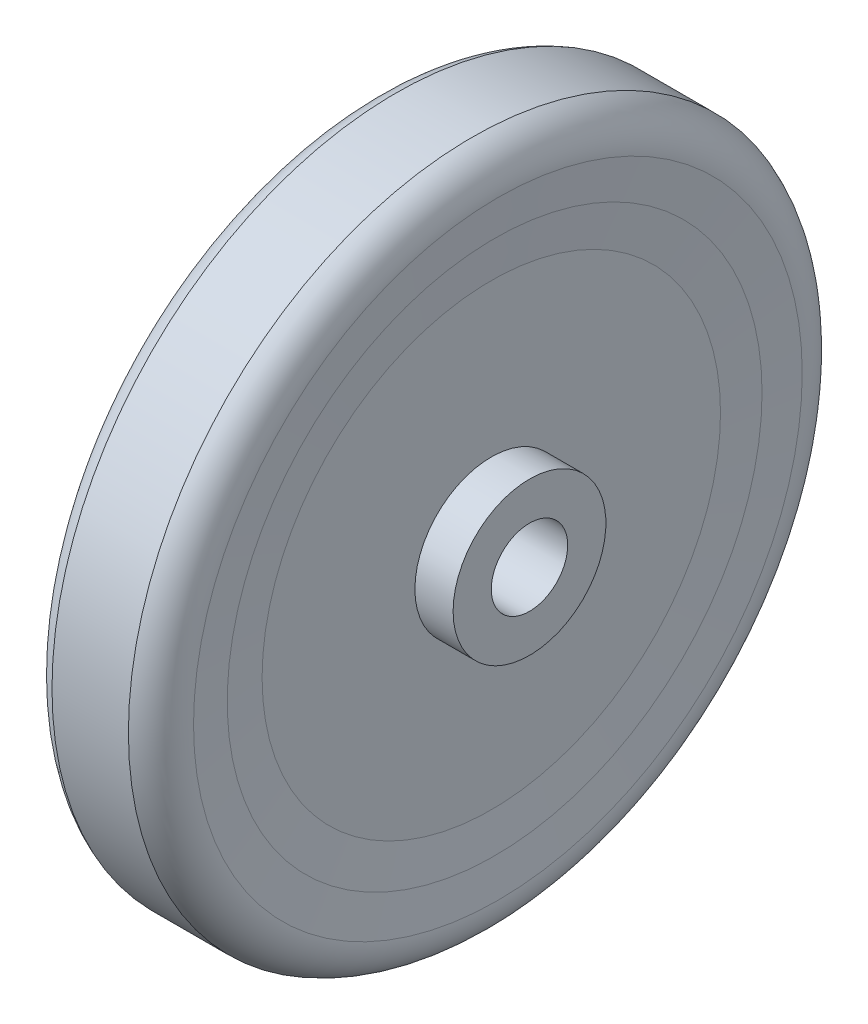
ISO-10303-21;
HEADER;
FILE_DESCRIPTION(('STEP AP214'),'2;1');
FILE_NAME('part.step','',(''),(''),'','','');
FILE_SCHEMA(('AUTOMOTIVE_DESIGN { 1 0 10303 214 1 1 1 1 }'));
ENDSEC;
DATA;
#1=APPLICATION_CONTEXT('core data for automotive mechanical design processes');
#2=APPLICATION_PROTOCOL_DEFINITION('international standard','automotive_design',2000,#1);
#3=PRODUCT_CONTEXT('',#1,'mechanical');
#4=PRODUCT('Part','Part','',(#3));
#5=PRODUCT_RELATED_PRODUCT_CATEGORY('part','',(#4));
#6=PRODUCT_DEFINITION_FORMATION('','',#4);
#7=PRODUCT_DEFINITION_CONTEXT('part definition',#1,'design');
#8=PRODUCT_DEFINITION('design','',#6,#7);
#9=PRODUCT_DEFINITION_SHAPE('','',#8);
#10=(LENGTH_UNIT() NAMED_UNIT(*) SI_UNIT(.MILLI.,.METRE.));
#11=(NAMED_UNIT(*) PLANE_ANGLE_UNIT() SI_UNIT($,.RADIAN.));
#12=(NAMED_UNIT(*) SI_UNIT($,.STERADIAN.) SOLID_ANGLE_UNIT());
#13=UNCERTAINTY_MEASURE_WITH_UNIT(LENGTH_MEASURE(1.E-05),#10,'distance_accuracy_value','');
#14=(GEOMETRIC_REPRESENTATION_CONTEXT(3) GLOBAL_UNCERTAINTY_ASSIGNED_CONTEXT((#13)) GLOBAL_UNIT_ASSIGNED_CONTEXT((#10,
#11,#12)) REPRESENTATION_CONTEXT('',''));
#15=CARTESIAN_POINT('',(0.,0.,0.));
#16=DIRECTION('',(0.,0.,1.));
#17=DIRECTION('',(1.,0.,0.));
#18=AXIS2_PLACEMENT_3D('',#15,#16,#17);
#19=CARTESIAN_POINT('',(-9.00000000000001,0.,0.));
#20=DIRECTION('',(1.,0.,0.));
#21=DIRECTION('',(0.,0.,-1.));
#22=AXIS2_PLACEMENT_3D('',#19,#20,#21);
#23=CYLINDRICAL_SURFACE('',#22,35.);
#24=CARTESIAN_POINT('',(-7.93744331762962,0.,0.));
#25=DIRECTION('',(-1.,0.,0.));
#26=DIRECTION('',(0.,0.,1.));
#27=AXIS2_PLACEMENT_3D('',#24,#25,#26);
#28=CIRCLE('',#27,35.);
#29=CARTESIAN_POINT('',(-7.93744331762962,0.,35.));
#30=VERTEX_POINT('',#29);
#31=EDGE_CURVE('E63',#30,#30,#28,.F.);
#32=ORIENTED_EDGE('',*,*,#31,.T.);
#33=EDGE_LOOP('',(#32));
#34=FACE_BOUND('',#33,.T.);
#35=CARTESIAN_POINT('',(7.93744331762962,0.,0.));
#36=DIRECTION('',(1.,0.,0.));
#37=DIRECTION('',(0.,0.,-1.));
#38=AXIS2_PLACEMENT_3D('',#35,#36,#37);
#39=CIRCLE('',#38,35.);
#40=CARTESIAN_POINT('',(7.93744331762962,0.,-35.));
#41=VERTEX_POINT('',#40);
#42=EDGE_CURVE('E51',#41,#41,#39,.F.);
#43=ORIENTED_EDGE('',*,*,#42,.T.);
#44=EDGE_LOOP('',(#43));
#45=FACE_BOUND('',#44,.T.);
#46=ADVANCED_FACE('F47',(#34,#45),#23,.T.);
#47=CARTESIAN_POINT('',(-8.36037581904776,0.,0.));
#48=DIRECTION('',(-1.,0.,0.));
#49=DIRECTION('',(0.,0.,1.));
#50=AXIS2_PLACEMENT_3D('',#47,#48,#49);
#51=CONICAL_SURFACE('',#50,39.834140611747,1.48352986419518);
#52=CARTESIAN_POINT('',(-7.5,0.,0.));
#53=DIRECTION('',(-1.,0.,0.));
#54=DIRECTION('',(0.,0.,1.));
#55=AXIS2_PLACEMENT_3D('',#52,#53,#54);
#56=CIRCLE('',#55,30.);
#57=CARTESIAN_POINT('',(-7.5,0.,30.));
#58=VERTEX_POINT('',#57);
#59=EDGE_CURVE('E65',#58,#58,#56,.T.);
#60=ORIENTED_EDGE('',*,*,#59,.F.);
#61=EDGE_LOOP('',(#60));
#62=FACE_BOUND('',#61,.T.);
#63=ORIENTED_EDGE('',*,*,#31,.F.);
#64=EDGE_LOOP('',(#63));
#65=FACE_BOUND('',#64,.T.);
#66=ADVANCED_FACE('F49',(#62,#65),#51,.F.);
#67=CARTESIAN_POINT('',(7.5,0.,0.));
#68=DIRECTION('',(1.,0.,0.));
#69=DIRECTION('',(0.,0.,-1.));
#70=AXIS2_PLACEMENT_3D('',#67,#68,#69);
#71=CONICAL_SURFACE('',#70,30.,1.48352986419518);
#72=CARTESIAN_POINT('',(7.5,0.,0.));
#73=DIRECTION('',(-1.,0.,0.));
#74=DIRECTION('',(0.,0.,1.));
#75=AXIS2_PLACEMENT_3D('',#72,#73,#74);
#76=CIRCLE('',#75,30.);
#77=CARTESIAN_POINT('',(7.5,0.,30.));
#78=VERTEX_POINT('',#77);
#79=EDGE_CURVE('E69',#78,#78,#76,.T.);
#80=ORIENTED_EDGE('',*,*,#79,.T.);
#81=EDGE_LOOP('',(#80));
#82=FACE_BOUND('',#81,.T.);
#83=ORIENTED_EDGE('',*,*,#42,.F.);
#84=EDGE_LOOP('',(#83));
#85=FACE_BOUND('',#84,.T.);
#86=ADVANCED_FACE('F75',(#82,#85),#71,.F.);
#87=CARTESIAN_POINT('',(-7.5,10.,0.));
#88=DIRECTION('',(1.,0.,0.));
#89=DIRECTION('',(0.,0.,-1.));
#90=AXIS2_PLACEMENT_3D('',#87,#88,#89);
#91=PLANE('',#90);
#92=CARTESIAN_POINT('',(-7.5,0.,0.));
#93=DIRECTION('',(-1.,0.,0.));
#94=DIRECTION('',(0.,0.,1.));
#95=AXIS2_PLACEMENT_3D('',#92,#93,#94);
#96=CIRCLE('',#95,10.);
#97=CARTESIAN_POINT('',(-7.5,0.,10.));
#98=VERTEX_POINT('',#97);
#99=EDGE_CURVE('E11',#98,#98,#96,.T.);
#100=ORIENTED_EDGE('',*,*,#99,.F.);
#101=EDGE_LOOP('',(#100));
#102=FACE_BOUND('',#101,.T.);
#103=ORIENTED_EDGE('',*,*,#59,.T.);
#104=EDGE_LOOP('',(#103));
#105=FACE_BOUND('',#104,.T.);
#106=ADVANCED_FACE('F77',(#102,#105),#91,.F.);
#107=CARTESIAN_POINT('',(7.5,30.,0.));
#108=DIRECTION('',(-1.,0.,0.));
#109=DIRECTION('',(0.,0.,1.));
#110=AXIS2_PLACEMENT_3D('',#107,#108,#109);
#111=PLANE('',#110);
#112=ORIENTED_EDGE('',*,*,#79,.F.);
#113=EDGE_LOOP('',(#112));
#114=FACE_BOUND('',#113,.T.);
#115=CARTESIAN_POINT('',(7.5,0.,0.));
#116=DIRECTION('',(-1.,0.,0.));
#117=DIRECTION('',(0.,0.,1.));
#118=AXIS2_PLACEMENT_3D('',#115,#116,#117);
#119=CIRCLE('',#118,10.);
#120=CARTESIAN_POINT('',(7.5,0.,10.));
#121=VERTEX_POINT('',#120);
#122=EDGE_CURVE('E119',#121,#121,#119,.T.);
#123=ORIENTED_EDGE('',*,*,#122,.T.);
#124=EDGE_LOOP('',(#123));
#125=FACE_BOUND('',#124,.T.);
#126=ADVANCED_FACE('F83',(#114,#125),#111,.F.);
#127=CARTESIAN_POINT('',(0.,0.,0.));
#128=DIRECTION('',(-1.,0.,0.));
#129=DIRECTION('',(0.,0.,1.));
#130=AXIS2_PLACEMENT_3D('',#127,#128,#129);
#131=CYLINDRICAL_SURFACE('',#130,10.);
#132=ORIENTED_EDGE('',*,*,#122,.F.);
#133=EDGE_LOOP('',(#132));
#134=FACE_BOUND('',#133,.T.);
#135=CARTESIAN_POINT('',(12.5,0.,0.));
#136=DIRECTION('',(-1.,0.,0.));
#137=DIRECTION('',(0.,0.,1.));
#138=AXIS2_PLACEMENT_3D('',#135,#136,#137);
#139=CIRCLE('',#138,10.);
#140=CARTESIAN_POINT('',(12.5,0.,10.));
#141=VERTEX_POINT('',#140);
#142=EDGE_CURVE('E120',#141,#141,#139,.T.);
#143=ORIENTED_EDGE('',*,*,#142,.T.);
#144=EDGE_LOOP('',(#143));
#145=FACE_BOUND('',#144,.T.);
#146=ADVANCED_FACE('F106',(#134,#145),#131,.T.);
#147=CARTESIAN_POINT('',(12.5,10.,0.));
#148=DIRECTION('',(-1.,0.,0.));
#149=DIRECTION('',(0.,0.,1.));
#150=AXIS2_PLACEMENT_3D('',#147,#148,#149);
#151=PLANE('',#150);
#152=ORIENTED_EDGE('',*,*,#142,.F.);
#153=EDGE_LOOP('',(#152));
#154=FACE_BOUND('',#153,.T.);
#155=CARTESIAN_POINT('',(12.5,0.,0.));
#156=DIRECTION('',(-1.,0.,0.));
#157=DIRECTION('',(0.,0.,1.));
#158=AXIS2_PLACEMENT_3D('',#155,#156,#157);
#159=CIRCLE('',#158,5.);
#160=CARTESIAN_POINT('',(12.5,0.,5.));
#161=VERTEX_POINT('',#160);
#162=EDGE_CURVE('E123',#161,#161,#159,.T.);
#163=ORIENTED_EDGE('',*,*,#162,.T.);
#164=EDGE_LOOP('',(#163));
#165=FACE_BOUND('',#164,.T.);
#166=ADVANCED_FACE('F102',(#154,#165),#151,.F.);
#167=CARTESIAN_POINT('',(0.,0.,0.));
#168=DIRECTION('',(-1.,0.,0.));
#169=DIRECTION('',(0.,0.,1.));
#170=AXIS2_PLACEMENT_3D('',#167,#168,#169);
#171=CYLINDRICAL_SURFACE('',#170,5.);
#172=ORIENTED_EDGE('',*,*,#162,.F.);
#173=EDGE_LOOP('',(#172));
#174=FACE_BOUND('',#173,.T.);
#175=CARTESIAN_POINT('',(-12.5,0.,0.));
#176=DIRECTION('',(-1.,0.,0.));
#177=DIRECTION('',(0.,0.,1.));
#178=AXIS2_PLACEMENT_3D('',#175,#176,#177);
#179=CIRCLE('',#178,5.);
#180=CARTESIAN_POINT('',(-12.5,0.,5.));
#181=VERTEX_POINT('',#180);
#182=EDGE_CURVE('E60',#181,#181,#179,.T.);
#183=ORIENTED_EDGE('',*,*,#182,.T.);
#184=EDGE_LOOP('',(#183));
#185=FACE_BOUND('',#184,.T.);
#186=ADVANCED_FACE('F98',(#174,#185),#171,.F.);
#187=CARTESIAN_POINT('',(-12.5,5.,0.));
#188=DIRECTION('',(1.,0.,0.));
#189=DIRECTION('',(0.,0.,-1.));
#190=AXIS2_PLACEMENT_3D('',#187,#188,#189);
#191=PLANE('',#190);
#192=ORIENTED_EDGE('',*,*,#182,.F.);
#193=EDGE_LOOP('',(#192));
#194=FACE_BOUND('',#193,.T.);
#195=CARTESIAN_POINT('',(-12.5,0.,0.));
#196=DIRECTION('',(-1.,0.,0.));
#197=DIRECTION('',(0.,0.,1.));
#198=AXIS2_PLACEMENT_3D('',#195,#196,#197);
#199=CIRCLE('',#198,10.);
#200=CARTESIAN_POINT('',(-12.5,0.,10.));
#201=VERTEX_POINT('',#200);
#202=EDGE_CURVE('E55',#201,#201,#199,.T.);
#203=ORIENTED_EDGE('',*,*,#202,.T.);
#204=EDGE_LOOP('',(#203));
#205=FACE_BOUND('',#204,.T.);
#206=ADVANCED_FACE('F94',(#194,#205),#191,.F.);
#207=CARTESIAN_POINT('',(0.,0.,0.));
#208=DIRECTION('',(-1.,0.,0.));
#209=DIRECTION('',(0.,0.,1.));
#210=AXIS2_PLACEMENT_3D('',#207,#208,#209);
#211=CYLINDRICAL_SURFACE('',#210,10.);
#212=ORIENTED_EDGE('',*,*,#202,.F.);
#213=EDGE_LOOP('',(#212));
#214=FACE_BOUND('',#213,.T.);
#215=ORIENTED_EDGE('',*,*,#99,.T.);
#216=EDGE_LOOP('',(#215));
#217=FACE_BOUND('',#216,.T.);
#218=ADVANCED_FACE('F91',(#214,#217),#211,.T.);
#219=CLOSED_SHELL('',(#46,#66,#86,#106,#126,#146,#166,#186,#206,#218));
#220=MANIFOLD_SOLID_BREP('B2',#219);
#221=CARTESIAN_POINT('',(-9.00000000000001,0.,0.));
#222=DIRECTION('',(1.,0.,0.));
#223=DIRECTION('',(0.,0.,-1.));
#224=AXIS2_PLACEMENT_3D('',#221,#222,#223);
#225=CYLINDRICAL_SURFACE('',#224,35.);
#226=CARTESIAN_POINT('',(7.93744331762962,0.,0.));
#227=DIRECTION('',(1.,0.,0.));
#228=DIRECTION('',(0.,0.,-1.));
#229=AXIS2_PLACEMENT_3D('',#226,#227,#228);
#230=CIRCLE('',#229,35.);
#231=CARTESIAN_POINT('',(7.93744331762962,0.,-35.));
#232=VERTEX_POINT('',#231);
#233=EDGE_CURVE('E205',#232,#232,#230,.F.);
#234=ORIENTED_EDGE('',*,*,#233,.F.);
#235=EDGE_LOOP('',(#234));
#236=FACE_BOUND('',#235,.T.);
#237=CARTESIAN_POINT('',(-7.93744331762962,0.,0.));
#238=DIRECTION('',(-1.,0.,0.));
#239=DIRECTION('',(0.,0.,1.));
#240=AXIS2_PLACEMENT_3D('',#237,#238,#239);
#241=CIRCLE('',#240,35.);
#242=CARTESIAN_POINT('',(-7.93744331762962,0.,35.));
#243=VERTEX_POINT('',#242);
#244=EDGE_CURVE('E46',#243,#243,#241,.F.);
#245=ORIENTED_EDGE('',*,*,#244,.F.);
#246=EDGE_LOOP('',(#245));
#247=FACE_BOUND('',#246,.T.);
#248=ADVANCED_FACE('F199',(#236,#247),#225,.F.);
#249=CARTESIAN_POINT('',(0.,0.,0.));
#250=DIRECTION('',(-1.,0.,0.));
#251=DIRECTION('',(0.,0.,1.));
#252=AXIS2_PLACEMENT_3D('',#249,#250,#251);
#253=CYLINDRICAL_SURFACE('',#252,45.);
#254=CARTESIAN_POINT('',(-5.,0.,0.));
#255=DIRECTION('',(-1.,0.,0.));
#256=DIRECTION('',(0.,0.,1.));
#257=AXIS2_PLACEMENT_3D('',#254,#255,#256);
#258=CIRCLE('',#257,45.);
#259=CARTESIAN_POINT('',(-5.,0.,45.));
#260=VERTEX_POINT('',#259);
#261=EDGE_CURVE('E213',#260,#260,#258,.T.);
#262=ORIENTED_EDGE('',*,*,#261,.F.);
#263=EDGE_LOOP('',(#262));
#264=FACE_BOUND('',#263,.T.);
#265=CARTESIAN_POINT('',(5.,0.,0.));
#266=DIRECTION('',(-1.,0.,0.));
#267=DIRECTION('',(0.,0.,1.));
#268=AXIS2_PLACEMENT_3D('',#265,#266,#267);
#269=CIRCLE('',#268,45.);
#270=CARTESIAN_POINT('',(5.,0.,45.));
#271=VERTEX_POINT('',#270);
#272=EDGE_CURVE('E218',#271,#271,#269,.T.);
#273=ORIENTED_EDGE('',*,*,#272,.T.);
#274=EDGE_LOOP('',(#273));
#275=FACE_BOUND('',#274,.T.);
#276=ADVANCED_FACE('F238',(#264,#275),#253,.T.);
#277=CARTESIAN_POINT('',(3.37940232858903,0.,0.));
#278=DIRECTION('',(-1.,0.,0.));
#279=DIRECTION('',(0.,0.,1.));
#280=AXIS2_PLACEMENT_3D('',#277,#278,#279);
#281=TOROIDAL_SURFACE('',#280,40.2699193254853,5.);
#282=ORIENTED_EDGE('',*,*,#272,.F.);
#283=EDGE_LOOP('',(#282));
#284=FACE_BOUND('',#283,.T.);
#285=CARTESIAN_POINT('',(8.36037581904776,0.,0.));
#286=DIRECTION('',(-1.,0.,0.));
#287=DIRECTION('',(0.,0.,1.));
#288=AXIS2_PLACEMENT_3D('',#285,#286,#287);
#289=CIRCLE('',#288,39.834140611747);
#290=CARTESIAN_POINT('',(8.36037581904776,0.,39.834140611747));
#291=VERTEX_POINT('',#290);
#292=EDGE_CURVE('E221',#291,#291,#289,.T.);
#293=ORIENTED_EDGE('',*,*,#292,.T.);
#294=EDGE_LOOP('',(#293));
#295=FACE_BOUND('',#294,.T.);
#296=ADVANCED_FACE('F225',(#284,#295),#281,.T.);
#297=CARTESIAN_POINT('',(7.5,0.,0.));
#298=DIRECTION('',(1.,0.,0.));
#299=DIRECTION('',(0.,0.,-1.));
#300=AXIS2_PLACEMENT_3D('',#297,#298,#299);
#301=CONICAL_SURFACE('',#300,30.,1.48352986419518);
#302=ORIENTED_EDGE('',*,*,#233,.T.);
#303=EDGE_LOOP('',(#302));
#304=FACE_BOUND('',#303,.T.);
#305=ORIENTED_EDGE('',*,*,#292,.F.);
#306=EDGE_LOOP('',(#305));
#307=FACE_BOUND('',#306,.T.);
#308=ADVANCED_FACE('F227',(#304,#307),#301,.F.);
#309=CARTESIAN_POINT('',(-3.37940232858903,0.,0.));
#310=DIRECTION('',(-1.,0.,0.));
#311=DIRECTION('',(0.,0.,1.));
#312=AXIS2_PLACEMENT_3D('',#309,#310,#311);
#313=TOROIDAL_SURFACE('',#312,40.2699193254853,5.);
#314=CARTESIAN_POINT('',(-8.36037581904776,0.,0.));
#315=DIRECTION('',(-1.,0.,0.));
#316=DIRECTION('',(0.,0.,1.));
#317=AXIS2_PLACEMENT_3D('',#314,#315,#316);
#318=CIRCLE('',#317,39.834140611747);
#319=CARTESIAN_POINT('',(-8.36037581904776,0.,39.834140611747));
#320=VERTEX_POINT('',#319);
#321=EDGE_CURVE('E209',#320,#320,#318,.T.);
#322=ORIENTED_EDGE('',*,*,#321,.F.);
#323=EDGE_LOOP('',(#322));
#324=FACE_BOUND('',#323,.T.);
#325=ORIENTED_EDGE('',*,*,#261,.T.);
#326=EDGE_LOOP('',(#325));
#327=FACE_BOUND('',#326,.T.);
#328=ADVANCED_FACE('F229',(#324,#327),#313,.T.);
#329=CARTESIAN_POINT('',(-8.36037581904776,0.,0.));
#330=DIRECTION('',(-1.,0.,0.));
#331=DIRECTION('',(0.,0.,1.));
#332=AXIS2_PLACEMENT_3D('',#329,#330,#331);
#333=CONICAL_SURFACE('',#332,39.834140611747,1.48352986419518);
#334=ORIENTED_EDGE('',*,*,#244,.T.);
#335=EDGE_LOOP('',(#334));
#336=FACE_BOUND('',#335,.T.);
#337=ORIENTED_EDGE('',*,*,#321,.T.);
#338=EDGE_LOOP('',(#337));
#339=FACE_BOUND('',#338,.T.);
#340=ADVANCED_FACE('F235',(#336,#339),#333,.F.);
#341=CLOSED_SHELL('',(#248,#276,#296,#308,#328,#340));
#342=MANIFOLD_SOLID_BREP('B6',#341);
#343=ADVANCED_BREP_SHAPE_REPRESENTATION('',(#18,#220,#342),#14);
#344=SHAPE_DEFINITION_REPRESENTATION(#9,#343);
ENDSEC;
END-ISO-10303-21;
